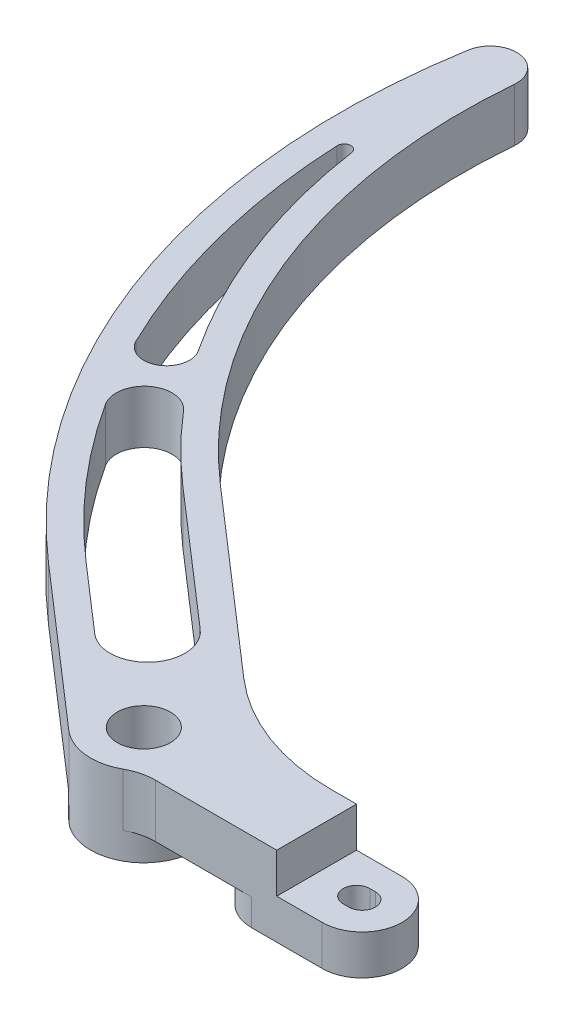
ISO-10303-21;
HEADER;
FILE_DESCRIPTION(('STEP AP214'),'2;1');
FILE_NAME('part.step','',(''),(''),'','','');
FILE_SCHEMA(('AUTOMOTIVE_DESIGN { 1 0 10303 214 1 1 1 1 }'));
ENDSEC;
DATA;
#1=APPLICATION_CONTEXT('core data for automotive mechanical design processes');
#2=APPLICATION_PROTOCOL_DEFINITION('international standard','automotive_design',2000,#1);
#3=PRODUCT_CONTEXT('',#1,'mechanical');
#4=PRODUCT('Part','Part','',(#3));
#5=PRODUCT_RELATED_PRODUCT_CATEGORY('part','',(#4));
#6=PRODUCT_DEFINITION_FORMATION('','',#4);
#7=PRODUCT_DEFINITION_CONTEXT('part definition',#1,'design');
#8=PRODUCT_DEFINITION('design','',#6,#7);
#9=PRODUCT_DEFINITION_SHAPE('','',#8);
#10=(LENGTH_UNIT() NAMED_UNIT(*) SI_UNIT(.MILLI.,.METRE.));
#11=(NAMED_UNIT(*) PLANE_ANGLE_UNIT() SI_UNIT($,.RADIAN.));
#12=(NAMED_UNIT(*) SI_UNIT($,.STERADIAN.) SOLID_ANGLE_UNIT());
#13=UNCERTAINTY_MEASURE_WITH_UNIT(LENGTH_MEASURE(1.E-05),#10,'distance_accuracy_value','');
#14=(GEOMETRIC_REPRESENTATION_CONTEXT(3) GLOBAL_UNCERTAINTY_ASSIGNED_CONTEXT((#13)) GLOBAL_UNIT_ASSIGNED_CONTEXT((#10,
#11,#12)) REPRESENTATION_CONTEXT('',''));
#15=CARTESIAN_POINT('',(0.,0.,0.));
#16=DIRECTION('',(0.,0.,1.));
#17=DIRECTION('',(1.,0.,0.));
#18=AXIS2_PLACEMENT_3D('',#15,#16,#17);
#19=CARTESIAN_POINT('',(1.33990270612822,12.7,165.1));
#20=DIRECTION('',(0.,-1.,0.));
#21=DIRECTION('',(0.,0.,-1.));
#22=AXIS2_PLACEMENT_3D('',#19,#20,#21);
#23=CYLINDRICAL_SURFACE('',#22,9.52500000000001);
#24=CARTESIAN_POINT('',(1.33990270612822,3.175,165.1));
#25=DIRECTION('',(0.,1.,0.));
#26=DIRECTION('',(0.,0.,1.));
#27=AXIS2_PLACEMENT_3D('',#24,#25,#26);
#28=CIRCLE('',#27,9.52500000000001);
#29=CARTESIAN_POINT('',(1.33990270612822,3.175,174.625));
#30=VERTEX_POINT('',#29);
#31=CARTESIAN_POINT('',(1.33990270612822,3.175,155.575));
#32=VERTEX_POINT('',#31);
#33=EDGE_CURVE('E48',#30,#32,#28,.T.);
#34=ORIENTED_EDGE('',*,*,#33,.F.);
#35=DIRECTION('',(0.,-1.,0.));
#36=VECTOR('',#35,1.);
#37=CARTESIAN_POINT('',(1.33990270612822,12.7,174.625));
#38=LINE('',#37,#36);
#39=CARTESIAN_POINT('',(1.33990270612822,-6.35,174.625));
#40=VERTEX_POINT('',#39);
#41=EDGE_CURVE('E283',#30,#40,#38,.T.);
#42=ORIENTED_EDGE('',*,*,#41,.T.);
#43=CARTESIAN_POINT('',(1.33990270612822,-6.35,165.1));
#44=DIRECTION('',(0.,1.,0.));
#45=DIRECTION('',(0.,0.,1.));
#46=AXIS2_PLACEMENT_3D('',#43,#44,#45);
#47=CIRCLE('',#46,9.52499999999998);
#48=CARTESIAN_POINT('',(1.33990270612822,-6.35,155.575));
#49=VERTEX_POINT('',#48);
#50=EDGE_CURVE('E359',#40,#49,#47,.T.);
#51=ORIENTED_EDGE('',*,*,#50,.T.);
#52=DIRECTION('',(0.,-1.,0.));
#53=VECTOR('',#52,1.);
#54=CARTESIAN_POINT('',(1.33990270612822,12.7,155.575));
#55=LINE('',#54,#53);
#56=EDGE_CURVE('E281',#32,#49,#55,.T.);
#57=ORIENTED_EDGE('',*,*,#56,.F.);
#58=EDGE_LOOP('',(#34,#42,#51,#57));
#59=FACE_BOUND('',#58,.T.);
#60=ADVANCED_FACE('F33',(#59),#23,.T.);
#61=CARTESIAN_POINT('',(0.,12.7,165.1));
#62=DIRECTION('',(0.,-1.,0.));
#63=DIRECTION('',(0.,0.,-1.));
#64=AXIS2_PLACEMENT_3D('',#61,#62,#63);
#65=CYLINDRICAL_SURFACE('',#64,3.17499999999998);
#66=DIRECTION('',(0.,-1.,0.));
#67=VECTOR('',#66,1.);
#68=CARTESIAN_POINT('',(0.,12.7,161.925));
#69=LINE('',#68,#67);
#70=CARTESIAN_POINT('',(0.,3.175,161.925));
#71=VERTEX_POINT('',#70);
#72=CARTESIAN_POINT('',(0.,-6.35,161.925));
#73=VERTEX_POINT('',#72);
#74=EDGE_CURVE('E308',#71,#73,#69,.T.);
#75=ORIENTED_EDGE('',*,*,#74,.F.);
#76=CARTESIAN_POINT('',(0.,3.175,165.1));
#77=DIRECTION('',(0.,1.,0.));
#78=DIRECTION('',(0.,0.,1.));
#79=AXIS2_PLACEMENT_3D('',#76,#77,#78);
#80=CIRCLE('',#79,3.17499999999998);
#81=CARTESIAN_POINT('',(0.,3.175,168.275));
#82=VERTEX_POINT('',#81);
#83=EDGE_CURVE('E56',#71,#82,#80,.T.);
#84=ORIENTED_EDGE('',*,*,#83,.T.);
#85=DIRECTION('',(0.,-1.,0.));
#86=VECTOR('',#85,1.);
#87=CARTESIAN_POINT('',(0.,12.7,168.275));
#88=LINE('',#87,#86);
#89=CARTESIAN_POINT('',(0.,-6.35,168.275));
#90=VERTEX_POINT('',#89);
#91=EDGE_CURVE('E329',#82,#90,#88,.T.);
#92=ORIENTED_EDGE('',*,*,#91,.T.);
#93=CARTESIAN_POINT('',(0.,-6.35,165.1));
#94=DIRECTION('',(0.,1.,0.));
#95=DIRECTION('',(0.,0.,1.));
#96=AXIS2_PLACEMENT_3D('',#93,#94,#95);
#97=CIRCLE('',#96,3.17499999999998);
#98=EDGE_CURVE('E316',#73,#90,#97,.T.);
#99=ORIENTED_EDGE('',*,*,#98,.F.);
#100=EDGE_LOOP('',(#75,#84,#92,#99));
#101=FACE_BOUND('',#100,.T.);
#102=ADVANCED_FACE('F313',(#101),#65,.F.);
#103=CARTESIAN_POINT('',(0.,12.7,168.275));
#104=DIRECTION('',(0.,0.,-1.));
#105=DIRECTION('',(-1.,0.,0.));
#106=AXIS2_PLACEMENT_3D('',#103,#104,#105);
#107=PLANE('',#106);
#108=ORIENTED_EDGE('',*,*,#91,.F.);
#109=DIRECTION('',(1.,0.,0.));
#110=VECTOR('',#109,1.);
#111=CARTESIAN_POINT('',(0.,3.175,168.275));
#112=LINE('',#111,#110);
#113=CARTESIAN_POINT('',(1.33990270612822,3.175,168.275));
#114=VERTEX_POINT('',#113);
#115=EDGE_CURVE('E859',#82,#114,#112,.T.);
#116=ORIENTED_EDGE('',*,*,#115,.T.);
#117=DIRECTION('',(0.,-1.,0.));
#118=VECTOR('',#117,1.);
#119=CARTESIAN_POINT('',(1.33990270612822,12.7,168.275));
#120=LINE('',#119,#118);
#121=CARTESIAN_POINT('',(1.33990270612822,-6.35,168.275));
#122=VERTEX_POINT('',#121);
#123=EDGE_CURVE('E320',#114,#122,#120,.T.);
#124=ORIENTED_EDGE('',*,*,#123,.T.);
#125=DIRECTION('',(1.,0.,0.));
#126=VECTOR('',#125,1.);
#127=CARTESIAN_POINT('',(0.,-6.35,168.275));
#128=LINE('',#127,#126);
#129=EDGE_CURVE('E360',#90,#122,#128,.T.);
#130=ORIENTED_EDGE('',*,*,#129,.F.);
#131=EDGE_LOOP('',(#108,#116,#124,#130));
#132=FACE_BOUND('',#131,.T.);
#133=ADVANCED_FACE('F494',(#132),#107,.T.);
#134=CARTESIAN_POINT('',(1.33990270612822,12.7,165.1));
#135=DIRECTION('',(0.,-1.,0.));
#136=DIRECTION('',(0.,0.,-1.));
#137=AXIS2_PLACEMENT_3D('',#134,#135,#136);
#138=CYLINDRICAL_SURFACE('',#137,3.17499999999998);
#139=ORIENTED_EDGE('',*,*,#123,.F.);
#140=CARTESIAN_POINT('',(1.33990270612822,3.175,165.1));
#141=DIRECTION('',(0.,1.,0.));
#142=DIRECTION('',(0.,0.,1.));
#143=AXIS2_PLACEMENT_3D('',#140,#141,#142);
#144=CIRCLE('',#143,3.17499999999998);
#145=CARTESIAN_POINT('',(1.33990270612822,3.175,161.925));
#146=VERTEX_POINT('',#145);
#147=EDGE_CURVE('E862',#114,#146,#144,.T.);
#148=ORIENTED_EDGE('',*,*,#147,.T.);
#149=DIRECTION('',(0.,-1.,0.));
#150=VECTOR('',#149,1.);
#151=CARTESIAN_POINT('',(1.33990270612822,12.7,161.925));
#152=LINE('',#151,#150);
#153=CARTESIAN_POINT('',(1.33990270612822,-6.35,161.925));
#154=VERTEX_POINT('',#153);
#155=EDGE_CURVE('E310',#146,#154,#152,.T.);
#156=ORIENTED_EDGE('',*,*,#155,.T.);
#157=CARTESIAN_POINT('',(1.33990270612822,-6.35,165.1));
#158=DIRECTION('',(0.,1.,0.));
#159=DIRECTION('',(0.,0.,1.));
#160=AXIS2_PLACEMENT_3D('',#157,#158,#159);
#161=CIRCLE('',#160,3.17499999999998);
#162=EDGE_CURVE('E849',#122,#154,#161,.T.);
#163=ORIENTED_EDGE('',*,*,#162,.F.);
#164=EDGE_LOOP('',(#139,#148,#156,#163));
#165=FACE_BOUND('',#164,.T.);
#166=ADVANCED_FACE('F548',(#165),#138,.F.);
#167=CARTESIAN_POINT('',(0.,12.7,161.925));
#168=DIRECTION('',(0.,0.,1.));
#169=DIRECTION('',(1.,0.,0.));
#170=AXIS2_PLACEMENT_3D('',#167,#168,#169);
#171=PLANE('',#170);
#172=ORIENTED_EDGE('',*,*,#155,.F.);
#173=DIRECTION('',(-1.,0.,0.));
#174=VECTOR('',#173,1.);
#175=CARTESIAN_POINT('',(0.,3.175,161.925));
#176=LINE('',#175,#174);
#177=EDGE_CURVE('E41',#146,#71,#176,.T.);
#178=ORIENTED_EDGE('',*,*,#177,.T.);
#179=ORIENTED_EDGE('',*,*,#74,.T.);
#180=DIRECTION('',(-1.,0.,0.));
#181=VECTOR('',#180,1.);
#182=CARTESIAN_POINT('',(1.33990270612822,-6.35,161.925));
#183=LINE('',#182,#181);
#184=EDGE_CURVE('E847',#154,#73,#183,.T.);
#185=ORIENTED_EDGE('',*,*,#184,.F.);
#186=EDGE_LOOP('',(#172,#178,#179,#185));
#187=FACE_BOUND('',#186,.T.);
#188=ADVANCED_FACE('F306',(#187),#171,.T.);
#189=CARTESIAN_POINT('',(-145.879223198508,0.,-12.7));
#190=DIRECTION('',(0.,-1.,0.));
#191=DIRECTION('',(0.,0.,-1.));
#192=AXIS2_PLACEMENT_3D('',#189,#190,#191);
#193=PLANE('',#192);
#194=CARTESIAN_POINT('',(-15.5569899676003,0.,165.1));
#195=DIRECTION('',(0.,1.,0.));
#196=DIRECTION('',(0.,0.,1.));
#197=AXIS2_PLACEMENT_3D('',#194,#195,#196);
#198=CIRCLE('',#197,9.52500000000001);
#199=CARTESIAN_POINT('',(-15.5569899676003,0.,155.575));
#200=VERTEX_POINT('',#199);
#201=CARTESIAN_POINT('',(-15.5569899676003,0.,174.625));
#202=VERTEX_POINT('',#201);
#203=EDGE_CURVE('E356',#200,#202,#198,.T.);
#204=ORIENTED_EDGE('',*,*,#203,.T.);
#205=DIRECTION('',(1.,0.,0.));
#206=VECTOR('',#205,1.);
#207=CARTESIAN_POINT('',(1.33990270612822,0.,174.625));
#208=LINE('',#207,#206);
#209=CARTESIAN_POINT('',(-38.5032778757914,0.,174.625));
#210=VERTEX_POINT('',#209);
#211=EDGE_CURVE('E262',#210,#202,#208,.T.);
#212=ORIENTED_EDGE('',*,*,#211,.F.);
#213=CARTESIAN_POINT('',(-38.5032778757914,0.,187.325));
#214=DIRECTION('',(0.,-1.,0.));
#215=DIRECTION('',(0.,0.,-1.));
#216=AXIS2_PLACEMENT_3D('',#213,#214,#215);
#217=CIRCLE('',#216,12.7);
#218=CARTESIAN_POINT('',(-44.6516389378957,0.,176.2125));
#219=VERTEX_POINT('',#218);
#220=EDGE_CURVE('E299',#210,#219,#217,.F.);
#221=ORIENTED_EDGE('',*,*,#220,.T.);
#222=CARTESIAN_POINT('',(-50.8,0.,165.1));
#223=DIRECTION('',(0.,1.,0.));
#224=DIRECTION('',(0.,0.,1.));
#225=AXIS2_PLACEMENT_3D('',#222,#223,#224);
#226=CIRCLE('',#225,12.7);
#227=CARTESIAN_POINT('',(-59.1319496681794,0.,174.684811668829));
#228=VERTEX_POINT('',#227);
#229=EDGE_CURVE('E378',#219,#228,#226,.T.);
#230=ORIENTED_EDGE('',*,*,#229,.T.);
#231=DIRECTION('',(0.754709580222773,0.,0.656059028990506));
#232=VECTOR('',#231,1.);
#233=CARTESIAN_POINT('',(-59.1319496681794,0.,174.684811668829));
#234=LINE('',#233,#232);
#235=CARTESIAN_POINT('',(-96.2537656380895,0.,142.415309362532));
#236=VERTEX_POINT('',#235);
#237=EDGE_CURVE('E259',#236,#228,#234,.T.);
#238=ORIENTED_EDGE('',*,*,#237,.F.);
#239=CARTESIAN_POINT('',(14.8935000837613,0.,14.5550063271155));
#240=DIRECTION('',(0.,1.,0.));
#241=DIRECTION('',(0.,0.,-1.));
#242=AXIS2_PLACEMENT_3D('',#239,#240,#241);
#243=CIRCLE('',#242,169.416562855443);
#244=CARTESIAN_POINT('',(-152.139898440356,0.,-13.7613413758565));
#245=VERTEX_POINT('',#244);
#246=EDGE_CURVE('E256',#245,#236,#243,.T.);
#247=ORIENTED_EDGE('',*,*,#246,.F.);
#248=CARTESIAN_POINT('',(-145.879223198508,0.,-12.7));
#249=DIRECTION('',(0.,1.,0.));
#250=DIRECTION('',(0.,0.,-1.));
#251=AXIS2_PLACEMENT_3D('',#248,#249,#250);
#252=CIRCLE('',#251,6.35000000000001);
#253=CARTESIAN_POINT('',(-139.553151073681,0.,-12.1492627927147));
#254=VERTEX_POINT('',#253);
#255=EDGE_CURVE('E253',#254,#245,#252,.T.);
#256=ORIENTED_EDGE('',*,*,#255,.F.);
#257=CARTESIAN_POINT('',(0.,0.,0.));
#258=DIRECTION('',(0.,-1.,0.));
#259=DIRECTION('',(0.,0.,1.));
#260=AXIS2_PLACEMENT_3D('',#257,#258,#259);
#261=CIRCLE('',#260,140.081);
#262=CARTESIAN_POINT('',(-91.9014048400191,0.,105.720472707186));
#263=VERTEX_POINT('',#262);
#264=EDGE_CURVE('E269',#263,#254,#261,.T.);
#265=ORIENTED_EDGE('',*,*,#264,.F.);
#266=DIRECTION('',(-0.754709580222773,0.,-0.656059028990507));
#267=VECTOR('',#266,1.);
#268=CARTESIAN_POINT('',(-91.901404840019,0.,105.720472707186));
#269=LINE('',#268,#267);
#270=CARTESIAN_POINT('',(-48.8847886403181,0.,143.114246675317));
#271=VERTEX_POINT('',#270);
#272=EDGE_CURVE('E267',#271,#263,#269,.T.);
#273=ORIENTED_EDGE('',*,*,#272,.F.);
#274=CARTESIAN_POINT('',(-15.5569899676003,0.,104.775));
#275=DIRECTION('',(0.,-1.,0.));
#276=DIRECTION('',(0.,0.,-1.));
#277=AXIS2_PLACEMENT_3D('',#274,#275,#276);
#278=CIRCLE('',#277,50.8);
#279=EDGE_CURVE('E265',#200,#271,#278,.T.);
#280=ORIENTED_EDGE('',*,*,#279,.F.);
#281=EDGE_LOOP('',(#204,#212,#221,#230,#238,#247,#256,#265,#273,#280));
#282=FACE_BOUND('',#281,.T.);
#283=CARTESIAN_POINT('',(14.8935000837613,0.,14.5550063271155));
#284=DIRECTION('',(0.,1.,0.));
#285=DIRECTION('',(0.,0.,1.));
#286=AXIS2_PLACEMENT_3D('',#283,#284,#285);
#287=CIRCLE('',#286,163.066562855443);
#288=CARTESIAN_POINT('',(-148.016867664179,0.,21.6905512760873));
#289=VERTEX_POINT('',#288);
#290=CARTESIAN_POINT('',(-131.624484339722,0.,86.1314281569896));
#291=VERTEX_POINT('',#290);
#292=EDGE_CURVE('E432',#289,#291,#287,.T.);
#293=ORIENTED_EDGE('',*,*,#292,.T.);
#294=CARTESIAN_POINT('',(-126.721193642061,0.,83.7360907879204));
#295=DIRECTION('',(0.,1.,0.));
#296=DIRECTION('',(0.,0.,-1.));
#297=AXIS2_PLACEMENT_3D('',#294,#295,#296);
#298=CIRCLE('',#297,5.45709636871345);
#299=CARTESIAN_POINT('',(-122.16830383571,0.,80.7275869756154));
#300=VERTEX_POINT('',#299);
#301=EDGE_CURVE('E435',#291,#300,#298,.T.);
#302=ORIENTED_EDGE('',*,*,#301,.T.);
#303=CARTESIAN_POINT('',(0.,0.,0.));
#304=DIRECTION('',(0.,-1.,0.));
#305=DIRECTION('',(0.,0.,1.));
#306=AXIS2_PLACEMENT_3D('',#303,#304,#305);
#307=CIRCLE('',#306,146.431);
#308=CARTESIAN_POINT('',(-144.860415421427,0.,21.3891983237218));
#309=VERTEX_POINT('',#308);
#310=EDGE_CURVE('E439',#300,#309,#307,.T.);
#311=ORIENTED_EDGE('',*,*,#310,.T.);
#312=CARTESIAN_POINT('',(-146.430888268581,0.,21.6210846888966));
#313=DIRECTION('',(0.,1.,0.));
#314=DIRECTION('',(0.,0.,-1.));
#315=AXIS2_PLACEMENT_3D('',#312,#313,#314);
#316=CIRCLE('',#315,1.58749999999998);
#317=EDGE_CURVE('E442',#309,#289,#316,.T.);
#318=ORIENTED_EDGE('',*,*,#317,.T.);
#319=EDGE_LOOP('',(#293,#302,#311,#318));
#320=FACE_BOUND('',#319,.T.);
#321=CARTESIAN_POINT('',(14.8935000837613,0.,14.5550063271155));
#322=DIRECTION('',(0.,1.,0.));
#323=DIRECTION('',(0.,0.,1.));
#324=AXIS2_PLACEMENT_3D('',#321,#322,#323);
#325=CIRCLE('',#324,163.066562855443);
#326=CARTESIAN_POINT('',(-122.222718656317,0.,102.815113283266));
#327=VERTEX_POINT('',#326);
#328=CARTESIAN_POINT('',(-92.0877908039998,0.,137.622903528117));
#329=VERTEX_POINT('',#328);
#330=EDGE_CURVE('E384',#327,#329,#325,.T.);
#331=ORIENTED_EDGE('',*,*,#330,.T.);
#332=DIRECTION('',(0.754709580222773,0.,0.656059028990506));
#333=VECTOR('',#332,1.);
#334=CARTESIAN_POINT('',(-92.0877908039998,0.,137.622903528117));
#335=LINE('',#334,#333);
#336=CARTESIAN_POINT('',(-75.9891210548345,0.,151.61726363755));
#337=VERTEX_POINT('',#336);
#338=EDGE_CURVE('E387',#329,#337,#335,.T.);
#339=ORIENTED_EDGE('',*,*,#338,.T.);
#340=CARTESIAN_POINT('',(-70.1340073197286,0.,144.881725775998));
#341=DIRECTION('',(0.,1.,0.));
#342=DIRECTION('',(0.,0.,-1.));
#343=AXIS2_PLACEMENT_3D('',#340,#341,#342);
#344=CIRCLE('',#343,8.92467518374877);
#345=CARTESIAN_POINT('',(-64.2788935846227,0.,138.146187914447));
#346=VERTEX_POINT('',#345);
#347=EDGE_CURVE('E391',#337,#346,#344,.T.);
#348=ORIENTED_EDGE('',*,*,#347,.T.);
#349=DIRECTION('',(-0.754709580222773,0.,-0.656059028990507));
#350=VECTOR('',#349,1.);
#351=CARTESIAN_POINT('',(-64.2788935846227,0.,138.146187914447));
#352=LINE('',#351,#350);
#353=CARTESIAN_POINT('',(-96.0673796741088,0.,110.512878541601));
#354=VERTEX_POINT('',#353);
#355=EDGE_CURVE('E394',#346,#354,#352,.T.);
#356=ORIENTED_EDGE('',*,*,#355,.T.);
#357=CARTESIAN_POINT('',(0.,0.,0.));
#358=DIRECTION('',(0.,-1.,0.));
#359=DIRECTION('',(0.,0.,1.));
#360=AXIS2_PLACEMENT_3D('',#357,#358,#359);
#361=CIRCLE('',#360,146.431);
#362=CARTESIAN_POINT('',(-111.532318828832,0.,94.8819246098213));
#363=VERTEX_POINT('',#362);
#364=EDGE_CURVE('E397',#354,#363,#361,.T.);
#365=ORIENTED_EDGE('',*,*,#364,.T.);
#366=CARTESIAN_POINT('',(-116.613386320555,0.,99.2044516383051));
#367=DIRECTION('',(0.,1.,0.));
#368=DIRECTION('',(0.,0.,-1.));
#369=AXIS2_PLACEMENT_3D('',#366,#367,#368);
#370=CIRCLE('',#369,6.67094346906177);
#371=EDGE_CURVE('E400',#363,#327,#370,.T.);
#372=ORIENTED_EDGE('',*,*,#371,.T.);
#373=EDGE_LOOP('',(#331,#339,#348,#356,#365,#372));
#374=FACE_BOUND('',#373,.T.);
#375=ADVANCED_FACE('F353',(#282,#320,#374),#193,.T.);
#376=CARTESIAN_POINT('',(-145.879223198508,12.7,-12.7));
#377=DIRECTION('',(0.,-1.,0.));
#378=DIRECTION('',(0.,0.,-1.));
#379=AXIS2_PLACEMENT_3D('',#376,#377,#378);
#380=PLANE('',#379);
#381=DIRECTION('',(0.754709580222773,0.,0.656059028990506));
#382=VECTOR('',#381,1.);
#383=CARTESIAN_POINT('',(-92.0877908039998,12.7,137.622903528117));
#384=LINE('',#383,#382);
#385=CARTESIAN_POINT('',(-92.0877908039998,12.7,137.622903528117));
#386=VERTEX_POINT('',#385);
#387=CARTESIAN_POINT('',(-75.9891210548345,12.7,151.61726363755));
#388=VERTEX_POINT('',#387);
#389=EDGE_CURVE('E405',#386,#388,#384,.T.);
#390=ORIENTED_EDGE('',*,*,#389,.F.);
#391=CARTESIAN_POINT('',(14.8935000837613,12.7,14.5550063271155));
#392=DIRECTION('',(0.,1.,0.));
#393=DIRECTION('',(0.,0.,1.));
#394=AXIS2_PLACEMENT_3D('',#391,#392,#393);
#395=CIRCLE('',#394,163.066562855443);
#396=CARTESIAN_POINT('',(-122.222718656317,12.7,102.815113283266));
#397=VERTEX_POINT('',#396);
#398=EDGE_CURVE('E382',#397,#386,#395,.T.);
#399=ORIENTED_EDGE('',*,*,#398,.F.);
#400=CARTESIAN_POINT('',(-116.613386320555,12.7,99.2044516383051));
#401=DIRECTION('',(0.,1.,0.));
#402=DIRECTION('',(0.,0.,-1.));
#403=AXIS2_PLACEMENT_3D('',#400,#401,#402);
#404=CIRCLE('',#403,6.67094346906177);
#405=CARTESIAN_POINT('',(-111.532318828832,12.7,94.8819246098213));
#406=VERTEX_POINT('',#405);
#407=EDGE_CURVE('E388',#406,#397,#404,.T.);
#408=ORIENTED_EDGE('',*,*,#407,.F.);
#409=CARTESIAN_POINT('',(0.,12.7,0.));
#410=DIRECTION('',(0.,-1.,0.));
#411=DIRECTION('',(0.,0.,1.));
#412=AXIS2_PLACEMENT_3D('',#409,#410,#411);
#413=CIRCLE('',#412,146.431);
#414=CARTESIAN_POINT('',(-96.0673796741088,12.7,110.512878541601));
#415=VERTEX_POINT('',#414);
#416=EDGE_CURVE('E414',#415,#406,#413,.T.);
#417=ORIENTED_EDGE('',*,*,#416,.F.);
#418=DIRECTION('',(-0.754709580222773,0.,-0.656059028990507));
#419=VECTOR('',#418,1.);
#420=CARTESIAN_POINT('',(-64.2788935846227,12.7,138.146187914447));
#421=LINE('',#420,#419);
#422=CARTESIAN_POINT('',(-64.2788935846227,12.7,138.146187914447));
#423=VERTEX_POINT('',#422);
#424=EDGE_CURVE('E411',#423,#415,#421,.T.);
#425=ORIENTED_EDGE('',*,*,#424,.F.);
#426=CARTESIAN_POINT('',(-70.1340073197286,12.7,144.881725775998));
#427=DIRECTION('',(0.,1.,0.));
#428=DIRECTION('',(0.,0.,-1.));
#429=AXIS2_PLACEMENT_3D('',#426,#427,#428);
#430=CIRCLE('',#429,8.92467518374877);
#431=EDGE_CURVE('E408',#388,#423,#430,.T.);
#432=ORIENTED_EDGE('',*,*,#431,.F.);
#433=EDGE_LOOP('',(#390,#399,#408,#417,#425,#432));
#434=FACE_BOUND('',#433,.T.);
#435=CARTESIAN_POINT('',(-126.721193642061,12.7,83.7360907879204));
#436=DIRECTION('',(0.,1.,0.));
#437=DIRECTION('',(0.,0.,-1.));
#438=AXIS2_PLACEMENT_3D('',#435,#436,#437);
#439=CIRCLE('',#438,5.45709636871345);
#440=CARTESIAN_POINT('',(-131.624484339722,12.7,86.1314281569896));
#441=VERTEX_POINT('',#440);
#442=CARTESIAN_POINT('',(-122.16830383571,12.7,80.7275869756154));
#443=VERTEX_POINT('',#442);
#444=EDGE_CURVE('E446',#441,#443,#439,.T.);
#445=ORIENTED_EDGE('',*,*,#444,.F.);
#446=CARTESIAN_POINT('',(14.8935000837613,12.7,14.5550063271155));
#447=DIRECTION('',(0.,1.,0.));
#448=DIRECTION('',(0.,0.,1.));
#449=AXIS2_PLACEMENT_3D('',#446,#447,#448);
#450=CIRCLE('',#449,163.066562855443);
#451=CARTESIAN_POINT('',(-148.016867664179,12.7,21.6905512760873));
#452=VERTEX_POINT('',#451);
#453=EDGE_CURVE('E421',#452,#441,#450,.T.);
#454=ORIENTED_EDGE('',*,*,#453,.F.);
#455=CARTESIAN_POINT('',(-146.430888268581,12.7,21.6210846888966));
#456=DIRECTION('',(0.,1.,0.));
#457=DIRECTION('',(0.,0.,-1.));
#458=AXIS2_PLACEMENT_3D('',#455,#456,#457);
#459=CIRCLE('',#458,1.58749999999998);
#460=CARTESIAN_POINT('',(-144.860415421427,12.7,21.3891983237218));
#461=VERTEX_POINT('',#460);
#462=EDGE_CURVE('E436',#461,#452,#459,.T.);
#463=ORIENTED_EDGE('',*,*,#462,.F.);
#464=CARTESIAN_POINT('',(0.,12.7,0.));
#465=DIRECTION('',(0.,-1.,0.));
#466=DIRECTION('',(0.,0.,1.));
#467=AXIS2_PLACEMENT_3D('',#464,#465,#466);
#468=CIRCLE('',#467,146.431);
#469=EDGE_CURVE('E449',#443,#461,#468,.T.);
#470=ORIENTED_EDGE('',*,*,#469,.F.);
#471=EDGE_LOOP('',(#445,#454,#463,#470));
#472=FACE_BOUND('',#471,.T.);
#473=CARTESIAN_POINT('',(-50.8,12.7,165.1));
#474=DIRECTION('',(0.,1.,0.));
#475=DIRECTION('',(0.,0.,1.));
#476=AXIS2_PLACEMENT_3D('',#473,#474,#475);
#477=CIRCLE('',#476,6.35);
#478=CARTESIAN_POINT('',(-50.8,12.7,171.45));
#479=VERTEX_POINT('',#478);
#480=EDGE_CURVE('E257',#479,#479,#477,.T.);
#481=ORIENTED_EDGE('',*,*,#480,.F.);
#482=EDGE_LOOP('',(#481));
#483=FACE_BOUND('',#482,.T.);
#484=DIRECTION('',(1.,0.,0.));
#485=VECTOR('',#484,1.);
#486=CARTESIAN_POINT('',(1.33990270612822,12.7,174.625));
#487=LINE('',#486,#485);
#488=CARTESIAN_POINT('',(-38.5032778757914,12.7,174.625));
#489=VERTEX_POINT('',#488);
#490=CARTESIAN_POINT('',(-9.52500000000001,12.7,174.625));
#491=VERTEX_POINT('',#490);
#492=EDGE_CURVE('E234',#489,#491,#487,.T.);
#493=ORIENTED_EDGE('',*,*,#492,.T.);
#494=DIRECTION('',(0.,0.,1.));
#495=VECTOR('',#494,1.);
#496=CARTESIAN_POINT('',(-9.52500000000001,12.7,150.458461468362));
#497=LINE('',#496,#495);
#498=CARTESIAN_POINT('',(-9.52500000000001,12.7,155.575));
#499=VERTEX_POINT('',#498);
#500=EDGE_CURVE('E222',#499,#491,#497,.T.);
#501=ORIENTED_EDGE('',*,*,#500,.F.);
#502=DIRECTION('',(-1.,0.,0.));
#503=VECTOR('',#502,1.);
#504=CARTESIAN_POINT('',(1.33990270612822,12.7,155.575));
#505=LINE('',#504,#503);
#506=CARTESIAN_POINT('',(-15.5569899676003,12.7,155.575));
#507=VERTEX_POINT('',#506);
#508=EDGE_CURVE('E231',#499,#507,#505,.T.);
#509=ORIENTED_EDGE('',*,*,#508,.T.);
#510=CARTESIAN_POINT('',(-15.5569899676003,12.7,104.775));
#511=DIRECTION('',(0.,-1.,0.));
#512=DIRECTION('',(0.,0.,-1.));
#513=AXIS2_PLACEMENT_3D('',#510,#511,#512);
#514=CIRCLE('',#513,50.8);
#515=CARTESIAN_POINT('',(-48.8847886403181,12.7,143.114246675317));
#516=VERTEX_POINT('',#515);
#517=EDGE_CURVE('E241',#507,#516,#514,.T.);
#518=ORIENTED_EDGE('',*,*,#517,.T.);
#519=DIRECTION('',(-0.754709580222773,0.,-0.656059028990507));
#520=VECTOR('',#519,1.);
#521=CARTESIAN_POINT('',(-91.901404840019,12.7,105.720472707186));
#522=LINE('',#521,#520);
#523=CARTESIAN_POINT('',(-91.9014048400191,12.7,105.720472707186));
#524=VERTEX_POINT('',#523);
#525=EDGE_CURVE('E243',#516,#524,#522,.T.);
#526=ORIENTED_EDGE('',*,*,#525,.T.);
#527=CARTESIAN_POINT('',(0.,12.7,0.));
#528=DIRECTION('',(0.,-1.,0.));
#529=DIRECTION('',(0.,0.,1.));
#530=AXIS2_PLACEMENT_3D('',#527,#528,#529);
#531=CIRCLE('',#530,140.081);
#532=CARTESIAN_POINT('',(-139.553151073681,12.7,-12.1492627927147));
#533=VERTEX_POINT('',#532);
#534=EDGE_CURVE('E250',#524,#533,#531,.T.);
#535=ORIENTED_EDGE('',*,*,#534,.T.);
#536=CARTESIAN_POINT('',(-145.879223198508,12.7,-12.7));
#537=DIRECTION('',(0.,1.,0.));
#538=DIRECTION('',(0.,0.,-1.));
#539=AXIS2_PLACEMENT_3D('',#536,#537,#538);
#540=CIRCLE('',#539,6.35000000000001);
#541=CARTESIAN_POINT('',(-152.139898440356,12.7,-13.7613413758565));
#542=VERTEX_POINT('',#541);
#543=EDGE_CURVE('E271',#533,#542,#540,.T.);
#544=ORIENTED_EDGE('',*,*,#543,.T.);
#545=CARTESIAN_POINT('',(14.8935000837613,12.7,14.5550063271155));
#546=DIRECTION('',(0.,1.,0.));
#547=DIRECTION('',(0.,0.,-1.));
#548=AXIS2_PLACEMENT_3D('',#545,#546,#547);
#549=CIRCLE('',#548,169.416562855443);
#550=CARTESIAN_POINT('',(-96.2537656380895,12.7,142.415309362532));
#551=VERTEX_POINT('',#550);
#552=EDGE_CURVE('E335',#542,#551,#549,.T.);
#553=ORIENTED_EDGE('',*,*,#552,.T.);
#554=DIRECTION('',(0.754709580222773,0.,0.656059028990506));
#555=VECTOR('',#554,1.);
#556=CARTESIAN_POINT('',(-59.1319496681794,12.7,174.684811668829));
#557=LINE('',#556,#555);
#558=CARTESIAN_POINT('',(-59.1319496681794,12.7,174.684811668829));
#559=VERTEX_POINT('',#558);
#560=EDGE_CURVE('E337',#551,#559,#557,.T.);
#561=ORIENTED_EDGE('',*,*,#560,.T.);
#562=CARTESIAN_POINT('',(-50.8,12.7,165.1));
#563=DIRECTION('',(0.,1.,0.));
#564=DIRECTION('',(0.,0.,-1.));
#565=AXIS2_PLACEMENT_3D('',#562,#563,#564);
#566=CIRCLE('',#565,12.7);
#567=CARTESIAN_POINT('',(-44.6516389378957,12.7,176.2125));
#568=VERTEX_POINT('',#567);
#569=EDGE_CURVE('E245',#559,#568,#566,.T.);
#570=ORIENTED_EDGE('',*,*,#569,.T.);
#571=CARTESIAN_POINT('',(-38.5032778757914,12.7,187.325));
#572=DIRECTION('',(0.,-1.,0.));
#573=DIRECTION('',(0.,0.,-1.));
#574=AXIS2_PLACEMENT_3D('',#571,#572,#573);
#575=CIRCLE('',#574,12.7);
#576=EDGE_CURVE('E302',#568,#489,#575,.T.);
#577=ORIENTED_EDGE('',*,*,#576,.T.);
#578=EDGE_LOOP('',(#493,#501,#509,#518,#526,#535,#544,#553,#561,#570,#577));
#579=FACE_BOUND('',#578,.T.);
#580=ADVANCED_FACE('F230',(#434,#472,#483,#579),#380,.F.);
#581=CARTESIAN_POINT('',(-145.879223198508,12.7,-12.7));
#582=DIRECTION('',(0.,-1.,0.));
#583=DIRECTION('',(0.,0.,-1.));
#584=AXIS2_PLACEMENT_3D('',#581,#582,#583);
#585=CYLINDRICAL_SURFACE('',#584,6.35000000000001);
#586=ORIENTED_EDGE('',*,*,#255,.T.);
#587=DIRECTION('',(0.,-1.,0.));
#588=VECTOR('',#587,1.);
#589=CARTESIAN_POINT('',(-152.139898440356,12.7,-13.7613413758565));
#590=LINE('',#589,#588);
#591=EDGE_CURVE('E291',#542,#245,#590,.T.);
#592=ORIENTED_EDGE('',*,*,#591,.F.);
#593=ORIENTED_EDGE('',*,*,#543,.F.);
#594=DIRECTION('',(0.,-1.,0.));
#595=VECTOR('',#594,1.);
#596=CARTESIAN_POINT('',(-139.553151073681,12.7,-12.1492627927147));
#597=LINE('',#596,#595);
#598=EDGE_CURVE('E252',#533,#254,#597,.T.);
#599=ORIENTED_EDGE('',*,*,#598,.T.);
#600=EDGE_LOOP('',(#586,#592,#593,#599));
#601=FACE_BOUND('',#600,.T.);
#602=ADVANCED_FACE('F510',(#601),#585,.T.);
#603=CARTESIAN_POINT('',(14.8935000837613,12.7,14.5550063271155));
#604=DIRECTION('',(0.,-1.,0.));
#605=DIRECTION('',(0.,0.,-1.));
#606=AXIS2_PLACEMENT_3D('',#603,#604,#605);
#607=CYLINDRICAL_SURFACE('',#606,169.416562855443);
#608=ORIENTED_EDGE('',*,*,#246,.T.);
#609=DIRECTION('',(0.,-1.,0.));
#610=VECTOR('',#609,1.);
#611=CARTESIAN_POINT('',(-96.2537656380895,12.7,142.415309362532));
#612=LINE('',#611,#610);
#613=EDGE_CURVE('E288',#551,#236,#612,.T.);
#614=ORIENTED_EDGE('',*,*,#613,.F.);
#615=ORIENTED_EDGE('',*,*,#552,.F.);
#616=ORIENTED_EDGE('',*,*,#591,.T.);
#617=EDGE_LOOP('',(#608,#614,#615,#616));
#618=FACE_BOUND('',#617,.T.);
#619=ADVANCED_FACE('F507',(#618),#607,.T.);
#620=CARTESIAN_POINT('',(-59.1319496681794,12.7,174.684811668829));
#621=DIRECTION('',(0.656059028990506,0.,-0.754709580222773));
#622=DIRECTION('',(-0.754709580222774,0.,-0.656059028990506));
#623=AXIS2_PLACEMENT_3D('',#620,#621,#622);
#624=PLANE('',#623);
#625=ORIENTED_EDGE('',*,*,#237,.T.);
#626=DIRECTION('',(0.,-1.,0.));
#627=VECTOR('',#626,1.);
#628=CARTESIAN_POINT('',(-59.1319496681794,12.7,174.684811668829));
#629=LINE('',#628,#627);
#630=EDGE_CURVE('E285',#559,#228,#629,.T.);
#631=ORIENTED_EDGE('',*,*,#630,.F.);
#632=ORIENTED_EDGE('',*,*,#560,.F.);
#633=ORIENTED_EDGE('',*,*,#613,.T.);
#634=EDGE_LOOP('',(#625,#631,#632,#633));
#635=FACE_BOUND('',#634,.T.);
#636=ADVANCED_FACE('F504',(#635),#624,.F.);
#637=CARTESIAN_POINT('',(-50.8,12.7,165.1));
#638=DIRECTION('',(0.,-1.,0.));
#639=DIRECTION('',(0.,0.,-1.));
#640=AXIS2_PLACEMENT_3D('',#637,#638,#639);
#641=CYLINDRICAL_SURFACE('',#640,12.7);
#642=ORIENTED_EDGE('',*,*,#630,.T.);
#643=ORIENTED_EDGE('',*,*,#229,.F.);
#644=DIRECTION('',(0.,-1.,0.));
#645=VECTOR('',#644,1.);
#646=CARTESIAN_POINT('',(-44.6516389378957,12.7,176.2125));
#647=LINE('',#646,#645);
#648=EDGE_CURVE('E297',#219,#568,#647,.F.);
#649=ORIENTED_EDGE('',*,*,#648,.T.);
#650=ORIENTED_EDGE('',*,*,#569,.F.);
#651=EDGE_LOOP('',(#642,#643,#649,#650));
#652=FACE_BOUND('',#651,.T.);
#653=CARTESIAN_POINT('',(-50.8,-6.35,165.1));
#654=DIRECTION('',(0.,1.,0.));
#655=DIRECTION('',(0.,0.,1.));
#656=AXIS2_PLACEMENT_3D('',#653,#654,#655);
#657=CIRCLE('',#656,12.7);
#658=CARTESIAN_POINT('',(-50.8,-6.35,177.8));
#659=VERTEX_POINT('',#658);
#660=EDGE_CURVE('E379',#659,#659,#657,.T.);
#661=ORIENTED_EDGE('',*,*,#660,.T.);
#662=EDGE_LOOP('',(#661));
#663=FACE_BOUND('',#662,.T.);
#664=ADVANCED_FACE('F501',(#652,#663),#641,.T.);
#665=CARTESIAN_POINT('',(1.33990270612822,12.7,174.625));
#666=DIRECTION('',(0.,0.,-1.));
#667=DIRECTION('',(-1.,0.,0.));
#668=AXIS2_PLACEMENT_3D('',#665,#666,#667);
#669=PLANE('',#668);
#670=DIRECTION('',(1.,0.,0.));
#671=VECTOR('',#670,1.);
#672=CARTESIAN_POINT('',(1.33990270612822,3.175,174.625));
#673=LINE('',#672,#671);
#674=CARTESIAN_POINT('',(-9.52500000000001,3.175,174.625));
#675=VERTEX_POINT('',#674);
#676=EDGE_CURVE('E853',#675,#30,#673,.T.);
#677=ORIENTED_EDGE('',*,*,#676,.F.);
#678=DIRECTION('',(0.,1.,0.));
#679=VECTOR('',#678,1.);
#680=CARTESIAN_POINT('',(-9.52500000000001,12.7,174.625));
#681=LINE('',#680,#679);
#682=EDGE_CURVE('E851',#675,#491,#681,.T.);
#683=ORIENTED_EDGE('',*,*,#682,.T.);
#684=ORIENTED_EDGE('',*,*,#492,.F.);
#685=DIRECTION('',(0.,1.,0.));
#686=VECTOR('',#685,1.);
#687=CARTESIAN_POINT('',(-38.5032778757914,0.,174.625));
#688=LINE('',#687,#686);
#689=EDGE_CURVE('E294',#489,#210,#688,.F.);
#690=ORIENTED_EDGE('',*,*,#689,.T.);
#691=ORIENTED_EDGE('',*,*,#211,.T.);
#692=DIRECTION('',(0.,1.,0.));
#693=VECTOR('',#692,1.);
#694=CARTESIAN_POINT('',(-15.5569899676003,-6.35,174.625));
#695=LINE('',#694,#693);
#696=CARTESIAN_POINT('',(-15.5569899676003,-6.35,174.625));
#697=VERTEX_POINT('',#696);
#698=EDGE_CURVE('E371',#697,#202,#695,.T.);
#699=ORIENTED_EDGE('',*,*,#698,.F.);
#700=DIRECTION('',(1.,0.,0.));
#701=VECTOR('',#700,1.);
#702=CARTESIAN_POINT('',(1.33990270612822,-6.35,174.625));
#703=LINE('',#702,#701);
#704=EDGE_CURVE('E369',#697,#40,#703,.T.);
#705=ORIENTED_EDGE('',*,*,#704,.T.);
#706=ORIENTED_EDGE('',*,*,#41,.F.);
#707=EDGE_LOOP('',(#677,#683,#684,#690,#691,#699,#705,#706));
#708=FACE_BOUND('',#707,.T.);
#709=ADVANCED_FACE('F350',(#708),#669,.F.);
#710=CARTESIAN_POINT('',(1.33990270612822,12.7,155.575));
#711=DIRECTION('',(0.,0.,1.));
#712=DIRECTION('',(1.,0.,0.));
#713=AXIS2_PLACEMENT_3D('',#710,#711,#712);
#714=PLANE('',#713);
#715=ORIENTED_EDGE('',*,*,#508,.F.);
#716=DIRECTION('',(0.,-1.,0.));
#717=VECTOR('',#716,1.);
#718=CARTESIAN_POINT('',(-9.52500000000001,12.7,155.575));
#719=LINE('',#718,#717);
#720=CARTESIAN_POINT('',(-9.52500000000001,3.175,155.575));
#721=VERTEX_POINT('',#720);
#722=EDGE_CURVE('E11',#499,#721,#719,.T.);
#723=ORIENTED_EDGE('',*,*,#722,.T.);
#724=DIRECTION('',(-1.,0.,0.));
#725=VECTOR('',#724,1.);
#726=CARTESIAN_POINT('',(1.33990270612822,3.175,155.575));
#727=LINE('',#726,#725);
#728=EDGE_CURVE('E856',#32,#721,#727,.T.);
#729=ORIENTED_EDGE('',*,*,#728,.F.);
#730=ORIENTED_EDGE('',*,*,#56,.T.);
#731=DIRECTION('',(-1.,0.,0.));
#732=VECTOR('',#731,1.);
#733=CARTESIAN_POINT('',(1.33990270612822,-6.35,155.575));
#734=LINE('',#733,#732);
#735=CARTESIAN_POINT('',(-15.5569899676003,-6.35,155.575));
#736=VERTEX_POINT('',#735);
#737=EDGE_CURVE('E363',#49,#736,#734,.T.);
#738=ORIENTED_EDGE('',*,*,#737,.T.);
#739=DIRECTION('',(0.,1.,0.));
#740=VECTOR('',#739,1.);
#741=CARTESIAN_POINT('',(-15.5569899676003,-6.35,155.575));
#742=LINE('',#741,#740);
#743=EDGE_CURVE('E374',#736,#200,#742,.T.);
#744=ORIENTED_EDGE('',*,*,#743,.T.);
#745=DIRECTION('',(0.,-1.,0.));
#746=VECTOR('',#745,1.);
#747=CARTESIAN_POINT('',(-15.5569899676003,12.7,155.575));
#748=LINE('',#747,#746);
#749=EDGE_CURVE('E239',#507,#200,#748,.T.);
#750=ORIENTED_EDGE('',*,*,#749,.F.);
#751=EDGE_LOOP('',(#715,#723,#729,#730,#738,#744,#750));
#752=FACE_BOUND('',#751,.T.);
#753=ADVANCED_FACE('F236',(#752),#714,.F.);
#754=CARTESIAN_POINT('',(-15.5569899676003,12.7,104.775));
#755=DIRECTION('',(0.,-1.,0.));
#756=DIRECTION('',(0.,0.,-1.));
#757=AXIS2_PLACEMENT_3D('',#754,#755,#756);
#758=CYLINDRICAL_SURFACE('',#757,50.8);
#759=ORIENTED_EDGE('',*,*,#279,.T.);
#760=DIRECTION('',(0.,-1.,0.));
#761=VECTOR('',#760,1.);
#762=CARTESIAN_POINT('',(-48.8847886403181,12.7,143.114246675317));
#763=LINE('',#762,#761);
#764=EDGE_CURVE('E277',#516,#271,#763,.T.);
#765=ORIENTED_EDGE('',*,*,#764,.F.);
#766=ORIENTED_EDGE('',*,*,#517,.F.);
#767=ORIENTED_EDGE('',*,*,#749,.T.);
#768=EDGE_LOOP('',(#759,#765,#766,#767));
#769=FACE_BOUND('',#768,.T.);
#770=ADVANCED_FACE('F534',(#769),#758,.F.);
#771=CARTESIAN_POINT('',(-91.901404840019,12.7,105.720472707186));
#772=DIRECTION('',(-0.656059028990507,0.,0.754709580222772));
#773=DIRECTION('',(0.754709580222773,0.,0.656059028990507));
#774=AXIS2_PLACEMENT_3D('',#771,#772,#773);
#775=PLANE('',#774);
#776=ORIENTED_EDGE('',*,*,#272,.T.);
#777=DIRECTION('',(0.,-1.,0.));
#778=VECTOR('',#777,1.);
#779=CARTESIAN_POINT('',(-91.9014048400191,12.7,105.720472707186));
#780=LINE('',#779,#778);
#781=EDGE_CURVE('E274',#524,#263,#780,.T.);
#782=ORIENTED_EDGE('',*,*,#781,.F.);
#783=ORIENTED_EDGE('',*,*,#525,.F.);
#784=ORIENTED_EDGE('',*,*,#764,.T.);
#785=EDGE_LOOP('',(#776,#782,#783,#784));
#786=FACE_BOUND('',#785,.T.);
#787=ADVANCED_FACE('F531',(#786),#775,.F.);
#788=CARTESIAN_POINT('',(0.,12.7,0.));
#789=DIRECTION('',(0.,-1.,0.));
#790=DIRECTION('',(0.,0.,-1.));
#791=AXIS2_PLACEMENT_3D('',#788,#789,#790);
#792=CYLINDRICAL_SURFACE('',#791,140.081);
#793=ORIENTED_EDGE('',*,*,#264,.T.);
#794=ORIENTED_EDGE('',*,*,#598,.F.);
#795=ORIENTED_EDGE('',*,*,#534,.F.);
#796=ORIENTED_EDGE('',*,*,#781,.T.);
#797=EDGE_LOOP('',(#793,#794,#795,#796));
#798=FACE_BOUND('',#797,.T.);
#799=ADVANCED_FACE('F483',(#798),#792,.F.);
#800=CARTESIAN_POINT('',(-50.8,12.7,165.1));
#801=DIRECTION('',(0.,-1.,0.));
#802=DIRECTION('',(0.,0.,-1.));
#803=AXIS2_PLACEMENT_3D('',#800,#801,#802);
#804=CYLINDRICAL_SURFACE('',#803,6.35);
#805=ORIENTED_EDGE('',*,*,#480,.T.);
#806=EDGE_LOOP('',(#805));
#807=FACE_BOUND('',#806,.T.);
#808=CARTESIAN_POINT('',(-50.8,-6.35,165.1));
#809=DIRECTION('',(0.,1.,0.));
#810=DIRECTION('',(0.,0.,1.));
#811=AXIS2_PLACEMENT_3D('',#808,#809,#810);
#812=CIRCLE('',#811,6.34999999999999);
#813=CARTESIAN_POINT('',(-50.8,-6.35,171.45));
#814=VERTEX_POINT('',#813);
#815=EDGE_CURVE('E373',#814,#814,#812,.T.);
#816=ORIENTED_EDGE('',*,*,#815,.F.);
#817=EDGE_LOOP('',(#816));
#818=FACE_BOUND('',#817,.T.);
#819=ADVANCED_FACE('F476',(#807,#818),#804,.F.);
#820=CARTESIAN_POINT('',(14.8935000837613,0.,14.5550063271155));
#821=DIRECTION('',(0.,1.,0.));
#822=DIRECTION('',(0.,0.,1.));
#823=AXIS2_PLACEMENT_3D('',#820,#821,#822);
#824=CYLINDRICAL_SURFACE('',#823,163.066562855443);
#825=ORIENTED_EDGE('',*,*,#453,.T.);
#826=DIRECTION('',(0.,1.,0.));
#827=VECTOR('',#826,1.);
#828=CARTESIAN_POINT('',(-131.624484339722,0.,86.1314281569896));
#829=LINE('',#828,#827);
#830=EDGE_CURVE('E325',#291,#441,#829,.T.);
#831=ORIENTED_EDGE('',*,*,#830,.F.);
#832=ORIENTED_EDGE('',*,*,#292,.F.);
#833=DIRECTION('',(0.,1.,0.));
#834=VECTOR('',#833,1.);
#835=CARTESIAN_POINT('',(-148.016867664179,0.,21.6905512760873));
#836=LINE('',#835,#834);
#837=EDGE_CURVE('E318',#289,#452,#836,.T.);
#838=ORIENTED_EDGE('',*,*,#837,.T.);
#839=EDGE_LOOP('',(#825,#831,#832,#838));
#840=FACE_BOUND('',#839,.T.);
#841=ADVANCED_FACE('F474',(#840),#824,.F.);
#842=CARTESIAN_POINT('',(-146.430888268581,0.,21.6210846888966));
#843=DIRECTION('',(0.,1.,0.));
#844=DIRECTION('',(0.,0.,1.));
#845=AXIS2_PLACEMENT_3D('',#842,#843,#844);
#846=CYLINDRICAL_SURFACE('',#845,1.58749999999998);
#847=ORIENTED_EDGE('',*,*,#462,.T.);
#848=ORIENTED_EDGE('',*,*,#837,.F.);
#849=ORIENTED_EDGE('',*,*,#317,.F.);
#850=DIRECTION('',(0.,1.,0.));
#851=VECTOR('',#850,1.);
#852=CARTESIAN_POINT('',(-144.860415421427,0.,21.3891983237218));
#853=LINE('',#852,#851);
#854=EDGE_CURVE('E322',#309,#461,#853,.T.);
#855=ORIENTED_EDGE('',*,*,#854,.T.);
#856=EDGE_LOOP('',(#847,#848,#849,#855));
#857=FACE_BOUND('',#856,.T.);
#858=ADVANCED_FACE('F472',(#857),#846,.F.);
#859=CARTESIAN_POINT('',(0.,0.,0.));
#860=DIRECTION('',(0.,1.,0.));
#861=DIRECTION('',(0.,0.,1.));
#862=AXIS2_PLACEMENT_3D('',#859,#860,#861);
#863=CYLINDRICAL_SURFACE('',#862,146.431);
#864=ORIENTED_EDGE('',*,*,#469,.T.);
#865=ORIENTED_EDGE('',*,*,#854,.F.);
#866=ORIENTED_EDGE('',*,*,#310,.F.);
#867=DIRECTION('',(0.,1.,0.));
#868=VECTOR('',#867,1.);
#869=CARTESIAN_POINT('',(-122.16830383571,0.,80.7275869756154));
#870=LINE('',#869,#868);
#871=EDGE_CURVE('E454',#300,#443,#870,.T.);
#872=ORIENTED_EDGE('',*,*,#871,.T.);
#873=EDGE_LOOP('',(#864,#865,#866,#872));
#874=FACE_BOUND('',#873,.T.);
#875=ADVANCED_FACE('F469',(#874),#863,.T.);
#876=CARTESIAN_POINT('',(-126.721193642061,0.,83.7360907879204));
#877=DIRECTION('',(0.,1.,0.));
#878=DIRECTION('',(0.,0.,1.));
#879=AXIS2_PLACEMENT_3D('',#876,#877,#878);
#880=CYLINDRICAL_SURFACE('',#879,5.45709636871345);
#881=ORIENTED_EDGE('',*,*,#444,.T.);
#882=ORIENTED_EDGE('',*,*,#871,.F.);
#883=ORIENTED_EDGE('',*,*,#301,.F.);
#884=ORIENTED_EDGE('',*,*,#830,.T.);
#885=EDGE_LOOP('',(#881,#882,#883,#884));
#886=FACE_BOUND('',#885,.T.);
#887=ADVANCED_FACE('F461',(#886),#880,.F.);
#888=CARTESIAN_POINT('',(14.8935000837613,0.,14.5550063271155));
#889=DIRECTION('',(0.,1.,0.));
#890=DIRECTION('',(0.,0.,1.));
#891=AXIS2_PLACEMENT_3D('',#888,#889,#890);
#892=CYLINDRICAL_SURFACE('',#891,163.066562855443);
#893=ORIENTED_EDGE('',*,*,#398,.T.);
#894=DIRECTION('',(0.,1.,0.));
#895=VECTOR('',#894,1.);
#896=CARTESIAN_POINT('',(-92.0877908039998,0.,137.622903528117));
#897=LINE('',#896,#895);
#898=EDGE_CURVE('E403',#329,#386,#897,.T.);
#899=ORIENTED_EDGE('',*,*,#898,.F.);
#900=ORIENTED_EDGE('',*,*,#330,.F.);
#901=DIRECTION('',(0.,1.,0.));
#902=VECTOR('',#901,1.);
#903=CARTESIAN_POINT('',(-122.222718656317,0.,102.815113283266));
#904=LINE('',#903,#902);
#905=EDGE_CURVE('E419',#327,#397,#904,.T.);
#906=ORIENTED_EDGE('',*,*,#905,.T.);
#907=EDGE_LOOP('',(#893,#899,#900,#906));
#908=FACE_BOUND('',#907,.T.);
#909=ADVANCED_FACE('F622',(#908),#892,.F.);
#910=CARTESIAN_POINT('',(-116.613386320555,0.,99.2044516383051));
#911=DIRECTION('',(0.,1.,0.));
#912=DIRECTION('',(0.,0.,1.));
#913=AXIS2_PLACEMENT_3D('',#910,#911,#912);
#914=CYLINDRICAL_SURFACE('',#913,6.67094346906177);
#915=ORIENTED_EDGE('',*,*,#407,.T.);
#916=ORIENTED_EDGE('',*,*,#905,.F.);
#917=ORIENTED_EDGE('',*,*,#371,.F.);
#918=DIRECTION('',(0.,1.,0.));
#919=VECTOR('',#918,1.);
#920=CARTESIAN_POINT('',(-111.532318828832,0.,94.8819246098213));
#921=LINE('',#920,#919);
#922=EDGE_CURVE('E422',#363,#406,#921,.T.);
#923=ORIENTED_EDGE('',*,*,#922,.T.);
#924=EDGE_LOOP('',(#915,#916,#917,#923));
#925=FACE_BOUND('',#924,.T.);
#926=ADVANCED_FACE('F618',(#925),#914,.F.);
#927=CARTESIAN_POINT('',(0.,0.,0.));
#928=DIRECTION('',(0.,1.,0.));
#929=DIRECTION('',(0.,0.,1.));
#930=AXIS2_PLACEMENT_3D('',#927,#928,#929);
#931=CYLINDRICAL_SURFACE('',#930,146.431);
#932=ORIENTED_EDGE('',*,*,#416,.T.);
#933=ORIENTED_EDGE('',*,*,#922,.F.);
#934=ORIENTED_EDGE('',*,*,#364,.F.);
#935=DIRECTION('',(0.,1.,0.));
#936=VECTOR('',#935,1.);
#937=CARTESIAN_POINT('',(-96.0673796741088,0.,110.512878541601));
#938=LINE('',#937,#936);
#939=EDGE_CURVE('E424',#354,#415,#938,.T.);
#940=ORIENTED_EDGE('',*,*,#939,.T.);
#941=EDGE_LOOP('',(#932,#933,#934,#940));
#942=FACE_BOUND('',#941,.T.);
#943=ADVANCED_FACE('F621',(#942),#931,.T.);
#944=CARTESIAN_POINT('',(-64.2788935846227,0.,138.146187914447));
#945=DIRECTION('',(0.656059028990507,0.,-0.754709580222773));
#946=DIRECTION('',(-0.754709580222773,0.,-0.656059028990507));
#947=AXIS2_PLACEMENT_3D('',#944,#945,#946);
#948=PLANE('',#947);
#949=ORIENTED_EDGE('',*,*,#424,.T.);
#950=ORIENTED_EDGE('',*,*,#939,.F.);
#951=ORIENTED_EDGE('',*,*,#355,.F.);
#952=DIRECTION('',(0.,1.,0.));
#953=VECTOR('',#952,1.);
#954=CARTESIAN_POINT('',(-64.2788935846227,0.,138.146187914447));
#955=LINE('',#954,#953);
#956=EDGE_CURVE('E426',#346,#423,#955,.T.);
#957=ORIENTED_EDGE('',*,*,#956,.T.);
#958=EDGE_LOOP('',(#949,#950,#951,#957));
#959=FACE_BOUND('',#958,.T.);
#960=ADVANCED_FACE('F626',(#959),#948,.F.);
#961=CARTESIAN_POINT('',(-70.1340073197286,0.,144.881725775998));
#962=DIRECTION('',(0.,1.,0.));
#963=DIRECTION('',(0.,0.,1.));
#964=AXIS2_PLACEMENT_3D('',#961,#962,#963);
#965=CYLINDRICAL_SURFACE('',#964,8.92467518374877);
#966=ORIENTED_EDGE('',*,*,#431,.T.);
#967=ORIENTED_EDGE('',*,*,#956,.F.);
#968=ORIENTED_EDGE('',*,*,#347,.F.);
#969=DIRECTION('',(0.,1.,0.));
#970=VECTOR('',#969,1.);
#971=CARTESIAN_POINT('',(-75.9891210548345,0.,151.61726363755));
#972=LINE('',#971,#970);
#973=EDGE_CURVE('E428',#337,#388,#972,.T.);
#974=ORIENTED_EDGE('',*,*,#973,.T.);
#975=EDGE_LOOP('',(#966,#967,#968,#974));
#976=FACE_BOUND('',#975,.T.);
#977=ADVANCED_FACE('F630',(#976),#965,.F.);
#978=CARTESIAN_POINT('',(-92.0877908039998,0.,137.622903528117));
#979=DIRECTION('',(-0.656059028990505,0.,0.754709580222773));
#980=DIRECTION('',(0.754709580222774,0.,0.656059028990506));
#981=AXIS2_PLACEMENT_3D('',#978,#979,#980);
#982=PLANE('',#981);
#983=ORIENTED_EDGE('',*,*,#389,.T.);
#984=ORIENTED_EDGE('',*,*,#973,.F.);
#985=ORIENTED_EDGE('',*,*,#338,.F.);
#986=ORIENTED_EDGE('',*,*,#898,.T.);
#987=EDGE_LOOP('',(#983,#984,#985,#986));
#988=FACE_BOUND('',#987,.T.);
#989=ADVANCED_FACE('F634',(#988),#982,.F.);
#990=CARTESIAN_POINT('',(-38.5032778757914,12.7,187.325));
#991=DIRECTION('',(0.,-1.,0.));
#992=DIRECTION('',(0.,0.,-1.));
#993=AXIS2_PLACEMENT_3D('',#990,#991,#992);
#994=CYLINDRICAL_SURFACE('',#993,12.7);
#995=ORIENTED_EDGE('',*,*,#576,.F.);
#996=ORIENTED_EDGE('',*,*,#648,.F.);
#997=ORIENTED_EDGE('',*,*,#220,.F.);
#998=ORIENTED_EDGE('',*,*,#689,.F.);
#999=EDGE_LOOP('',(#995,#996,#997,#998));
#1000=FACE_BOUND('',#999,.T.);
#1001=ADVANCED_FACE('F35',(#1000),#994,.F.);
#1002=CARTESIAN_POINT('',(-50.8,-6.35,165.1));
#1003=DIRECTION('',(0.,1.,0.));
#1004=DIRECTION('',(0.,0.,1.));
#1005=AXIS2_PLACEMENT_3D('',#1002,#1003,#1004);
#1006=PLANE('',#1005);
#1007=ORIENTED_EDGE('',*,*,#815,.T.);
#1008=EDGE_LOOP('',(#1007));
#1009=FACE_BOUND('',#1008,.T.);
#1010=ORIENTED_EDGE('',*,*,#660,.F.);
#1011=EDGE_LOOP('',(#1010));
#1012=FACE_BOUND('',#1011,.T.);
#1013=ADVANCED_FACE('F614',(#1009,#1012),#1006,.F.);
#1014=CARTESIAN_POINT('',(-15.5569899676003,-6.35,165.1));
#1015=DIRECTION('',(0.,1.,0.));
#1016=DIRECTION('',(0.,0.,1.));
#1017=AXIS2_PLACEMENT_3D('',#1014,#1015,#1016);
#1018=CYLINDRICAL_SURFACE('',#1017,9.52500000000001);
#1019=ORIENTED_EDGE('',*,*,#203,.F.);
#1020=ORIENTED_EDGE('',*,*,#743,.F.);
#1021=CARTESIAN_POINT('',(-15.5569899676003,-6.35,165.1));
#1022=DIRECTION('',(0.,1.,0.));
#1023=DIRECTION('',(0.,0.,1.));
#1024=AXIS2_PLACEMENT_3D('',#1021,#1022,#1023);
#1025=CIRCLE('',#1024,9.52500000000001);
#1026=EDGE_CURVE('E843',#736,#697,#1025,.T.);
#1027=ORIENTED_EDGE('',*,*,#1026,.T.);
#1028=ORIENTED_EDGE('',*,*,#698,.T.);
#1029=EDGE_LOOP('',(#1019,#1020,#1027,#1028));
#1030=FACE_BOUND('',#1029,.T.);
#1031=ADVANCED_FACE('F610',(#1030),#1018,.T.);
#1032=CARTESIAN_POINT('',(1.33990270612822,-6.35,165.1));
#1033=DIRECTION('',(0.,1.,0.));
#1034=DIRECTION('',(0.,0.,1.));
#1035=AXIS2_PLACEMENT_3D('',#1032,#1033,#1034);
#1036=PLANE('',#1035);
#1037=ORIENTED_EDGE('',*,*,#129,.T.);
#1038=ORIENTED_EDGE('',*,*,#162,.T.);
#1039=ORIENTED_EDGE('',*,*,#184,.T.);
#1040=ORIENTED_EDGE('',*,*,#98,.T.);
#1041=EDGE_LOOP('',(#1037,#1038,#1039,#1040));
#1042=FACE_BOUND('',#1041,.T.);
#1043=ORIENTED_EDGE('',*,*,#50,.F.);
#1044=ORIENTED_EDGE('',*,*,#704,.F.);
#1045=ORIENTED_EDGE('',*,*,#1026,.F.);
#1046=ORIENTED_EDGE('',*,*,#737,.F.);
#1047=EDGE_LOOP('',(#1043,#1044,#1045,#1046));
#1048=FACE_BOUND('',#1047,.T.);
#1049=ADVANCED_FACE('F594',(#1042,#1048),#1036,.F.);
#1050=CARTESIAN_POINT('',(-9.52500000000001,3.175,150.458461468362));
#1051=DIRECTION('',(-1.,0.,0.));
#1052=DIRECTION('',(0.,0.,1.));
#1053=AXIS2_PLACEMENT_3D('',#1050,#1051,#1052);
#1054=PLANE('',#1053);
#1055=DIRECTION('',(0.,0.,1.));
#1056=VECTOR('',#1055,1.);
#1057=CARTESIAN_POINT('',(-9.52500000000001,3.175,150.458461468362));
#1058=LINE('',#1057,#1056);
#1059=EDGE_CURVE('E225',#721,#675,#1058,.T.);
#1060=ORIENTED_EDGE('',*,*,#1059,.F.);
#1061=ORIENTED_EDGE('',*,*,#722,.F.);
#1062=ORIENTED_EDGE('',*,*,#500,.T.);
#1063=ORIENTED_EDGE('',*,*,#682,.F.);
#1064=EDGE_LOOP('',(#1060,#1061,#1062,#1063));
#1065=FACE_BOUND('',#1064,.T.);
#1066=ADVANCED_FACE('F221',(#1065),#1054,.F.);
#1067=CARTESIAN_POINT('',(0.,3.175,0.));
#1068=DIRECTION('',(0.,1.,0.));
#1069=DIRECTION('',(0.,0.,1.));
#1070=AXIS2_PLACEMENT_3D('',#1067,#1068,#1069);
#1071=PLANE('',#1070);
#1072=ORIENTED_EDGE('',*,*,#177,.F.);
#1073=ORIENTED_EDGE('',*,*,#147,.F.);
#1074=ORIENTED_EDGE('',*,*,#115,.F.);
#1075=ORIENTED_EDGE('',*,*,#83,.F.);
#1076=EDGE_LOOP('',(#1072,#1073,#1074,#1075));
#1077=FACE_BOUND('',#1076,.T.);
#1078=ORIENTED_EDGE('',*,*,#676,.T.);
#1079=ORIENTED_EDGE('',*,*,#33,.T.);
#1080=ORIENTED_EDGE('',*,*,#728,.T.);
#1081=ORIENTED_EDGE('',*,*,#1059,.T.);
#1082=EDGE_LOOP('',(#1078,#1079,#1080,#1081));
#1083=FACE_BOUND('',#1082,.T.);
#1084=ADVANCED_FACE('F593',(#1077,#1083),#1071,.T.);
#1085=CLOSED_SHELL('',(#60,#102,#133,#166,#188,#375,#580,#602,#619,#636,#664,#709,#753,#770,
#787,#799,#819,#841,#858,#875,#887,#909,#926,#943,#960,#977,#989,#1001,#1013,#1031,#1049,#1066,#1084));
#1086=MANIFOLD_SOLID_BREP('B2',#1085);
#1087=ADVANCED_BREP_SHAPE_REPRESENTATION('',(#18,#1086),#14);
#1088=SHAPE_DEFINITION_REPRESENTATION(#9,#1087);
ENDSEC;
END-ISO-10303-21;
